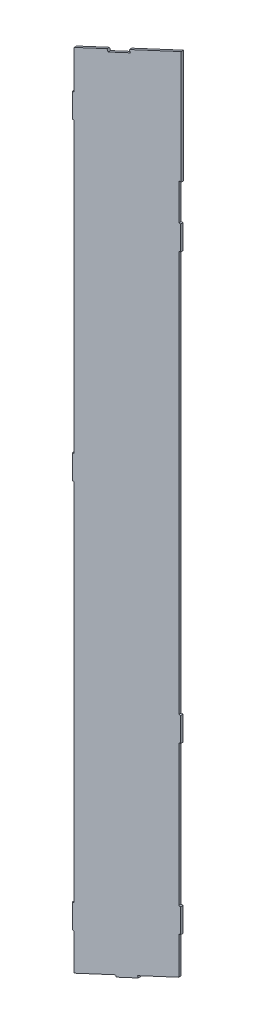
ISO-10303-21;
HEADER;
FILE_DESCRIPTION(('STEP AP214'),'2;1');
FILE_NAME('part.step','',(''),(''),'','','');
FILE_SCHEMA(('AUTOMOTIVE_DESIGN { 1 0 10303 214 1 1 1 1 }'));
ENDSEC;
DATA;
#1=APPLICATION_CONTEXT('core data for automotive mechanical design processes');
#2=APPLICATION_PROTOCOL_DEFINITION('international standard','automotive_design',2000,#1);
#3=PRODUCT_CONTEXT('',#1,'mechanical');
#4=PRODUCT('Part','Part','',(#3));
#5=PRODUCT_RELATED_PRODUCT_CATEGORY('part','',(#4));
#6=PRODUCT_DEFINITION_FORMATION('','',#4);
#7=PRODUCT_DEFINITION_CONTEXT('part definition',#1,'design');
#8=PRODUCT_DEFINITION('design','',#6,#7);
#9=PRODUCT_DEFINITION_SHAPE('','',#8);
#10=(LENGTH_UNIT() NAMED_UNIT(*) SI_UNIT(.MILLI.,.METRE.));
#11=(NAMED_UNIT(*) PLANE_ANGLE_UNIT() SI_UNIT($,.RADIAN.));
#12=(NAMED_UNIT(*) SI_UNIT($,.STERADIAN.) SOLID_ANGLE_UNIT());
#13=UNCERTAINTY_MEASURE_WITH_UNIT(LENGTH_MEASURE(1.E-05),#10,'distance_accuracy_value','');
#14=(GEOMETRIC_REPRESENTATION_CONTEXT(3) GLOBAL_UNCERTAINTY_ASSIGNED_CONTEXT((#13)) GLOBAL_UNIT_ASSIGNED_CONTEXT((#10,
#11,#12)) REPRESENTATION_CONTEXT('',''));
#15=CARTESIAN_POINT('',(0.,0.,0.));
#16=DIRECTION('',(0.,0.,1.));
#17=DIRECTION('',(1.,0.,0.));
#18=AXIS2_PLACEMENT_3D('',#15,#16,#17);
#19=CARTESIAN_POINT('',(1.2490009027033E-13,46.5,62.));
#20=DIRECTION('',(0.4226182617407,-0.90630778703665,0.));
#21=DIRECTION('',(0.90630778703665,0.4226182617407,0.));
#22=AXIS2_PLACEMENT_3D('',#19,#20,#21);
#23=PLANE('',#22);
#24=DIRECTION('',(-0.906307787036649,-0.4226182617407,0.));
#25=VECTOR('',#24,1.);
#26=CARTESIAN_POINT('',(1.2490009027033E-13,46.5,62.));
#27=LINE('',#26,#25);
#28=CARTESIAN_POINT('',(-60.9945140675664,18.0577909848508,62.));
#29=VERTEX_POINT('',#28);
#30=CARTESIAN_POINT('',(-87.9999999999998,5.46492608236004,62.));
#31=VERTEX_POINT('',#30);
#32=EDGE_CURVE('E385',#29,#31,#27,.T.);
#33=ORIENTED_EDGE('',*,*,#32,.F.);
#34=DIRECTION('',(0.,0.,-1.));
#35=VECTOR('',#34,1.);
#36=CARTESIAN_POINT('',(-60.9945140675664,18.0577909848508,62.));
#37=LINE('',#36,#35);
#38=CARTESIAN_POINT('',(-60.9945140675664,18.0577909848508,60.));
#39=VERTEX_POINT('',#38);
#40=EDGE_CURVE('E577',#29,#39,#37,.T.);
#41=ORIENTED_EDGE('',*,*,#40,.T.);
#42=DIRECTION('',(-0.906307787036649,-0.4226182617407,0.));
#43=VECTOR('',#42,1.);
#44=CARTESIAN_POINT('',(1.2490009027033E-13,46.5,60.));
#45=LINE('',#44,#43);
#46=CARTESIAN_POINT('',(-87.9999999999998,5.46492608236004,60.));
#47=VERTEX_POINT('',#46);
#48=EDGE_CURVE('E301',#39,#47,#45,.T.);
#49=ORIENTED_EDGE('',*,*,#48,.T.);
#50=DIRECTION('',(0.,0.,-1.));
#51=VECTOR('',#50,1.);
#52=CARTESIAN_POINT('',(-87.9999999999998,5.46492608236004,62.));
#53=LINE('',#52,#51);
#54=EDGE_CURVE('E317',#31,#47,#53,.T.);
#55=ORIENTED_EDGE('',*,*,#54,.F.);
#56=EDGE_LOOP('',(#33,#41,#49,#55));
#57=FACE_BOUND('',#56,.T.);
#58=ADVANCED_FACE('F36',(#57),#23,.F.);
#59=CARTESIAN_POINT('',(-1.99999999999979,-613.65889832121,62.));
#60=DIRECTION('',(-0.422618261740701,0.906307787036649,0.));
#61=DIRECTION('',(-0.906307787036649,-0.422618261740701,0.));
#62=AXIS2_PLACEMENT_3D('',#59,#60,#61);
#63=PLANE('',#62);
#64=DIRECTION('',(0.906307787036649,0.422618261740701,0.));
#65=VECTOR('',#64,1.);
#66=CARTESIAN_POINT('',(-1.99999999999979,-613.65889832121,60.));
#67=LINE('',#66,#65);
#68=CARTESIAN_POINT('',(-87.9999999999998,-653.76135692254,60.));
#69=VERTEX_POINT('',#68);
#70=CARTESIAN_POINT('',(-54.0630778703664,-637.936310239282,60.));
#71=VERTEX_POINT('',#70);
#72=EDGE_CURVE('E337',#69,#71,#67,.T.);
#73=ORIENTED_EDGE('',*,*,#72,.T.);
#74=DIRECTION('',(0.,0.,1.));
#75=VECTOR('',#74,1.);
#76=CARTESIAN_POINT('',(-54.0630778703619,-637.936310239291,60.));
#77=LINE('',#76,#75);
#78=CARTESIAN_POINT('',(-54.0630778703664,-637.936310239282,62.));
#79=VERTEX_POINT('',#78);
#80=EDGE_CURVE('E552',#71,#79,#77,.T.);
#81=ORIENTED_EDGE('',*,*,#80,.T.);
#82=DIRECTION('',(0.906307787036649,0.422618261740701,0.));
#83=VECTOR('',#82,1.);
#84=CARTESIAN_POINT('',(-1.99999999999979,-613.65889832121,62.));
#85=LINE('',#84,#83);
#86=CARTESIAN_POINT('',(-87.9999999999998,-653.76135692254,62.));
#87=VERTEX_POINT('',#86);
#88=EDGE_CURVE('E340',#87,#79,#85,.T.);
#89=ORIENTED_EDGE('',*,*,#88,.F.);
#90=DIRECTION('',(0.,0.,-1.));
#91=VECTOR('',#90,1.);
#92=CARTESIAN_POINT('',(-87.9999999999998,-653.76135692254,62.));
#93=LINE('',#92,#91);
#94=EDGE_CURVE('E44',#87,#69,#93,.T.);
#95=ORIENTED_EDGE('',*,*,#94,.T.);
#96=EDGE_LOOP('',(#73,#81,#89,#95));
#97=FACE_BOUND('',#96,.T.);
#98=ADVANCED_FACE('F335',(#97),#63,.F.);
#99=CARTESIAN_POINT('',(-1.99999999999986,-46.5,62.));
#100=DIRECTION('',(-1.,0.,0.));
#101=DIRECTION('',(0.,-1.,0.));
#102=AXIS2_PLACEMENT_3D('',#99,#100,#101);
#103=PLANE('',#102);
#104=DIRECTION('',(0.,1.,0.));
#105=VECTOR('',#104,1.);
#106=CARTESIAN_POINT('',(-1.99999999999986,-46.5,62.));
#107=LINE('',#106,#105);
#108=CARTESIAN_POINT('',(-1.99999999999979,-562.7262830049,62.));
#109=VERTEX_POINT('',#108);
#110=CARTESIAN_POINT('',(-1.99999999999981,-446.5,62.));
#111=VERTEX_POINT('',#110);
#112=EDGE_CURVE('E393',#109,#111,#107,.T.);
#113=ORIENTED_EDGE('',*,*,#112,.F.);
#114=DIRECTION('',(0.,0.,1.));
#115=VECTOR('',#114,1.);
#116=CARTESIAN_POINT('',(-1.99999999999986,-562.7262830049,60.));
#117=LINE('',#116,#115);
#118=CARTESIAN_POINT('',(-1.99999999999986,-562.7262830049,60.));
#119=VERTEX_POINT('',#118);
#120=EDGE_CURVE('E525',#119,#109,#117,.T.);
#121=ORIENTED_EDGE('',*,*,#120,.F.);
#122=DIRECTION('',(0.,1.,0.));
#123=VECTOR('',#122,1.);
#124=CARTESIAN_POINT('',(-1.99999999999986,-46.5,60.));
#125=LINE('',#124,#123);
#126=CARTESIAN_POINT('',(-1.99999999999981,-446.5,60.));
#127=VERTEX_POINT('',#126);
#128=EDGE_CURVE('E363',#119,#127,#125,.T.);
#129=ORIENTED_EDGE('',*,*,#128,.T.);
#130=DIRECTION('',(0.,0.,1.));
#131=VECTOR('',#130,1.);
#132=CARTESIAN_POINT('',(-1.99999999999977,-446.5,60.));
#133=LINE('',#132,#131);
#134=EDGE_CURVE('E505',#127,#111,#133,.T.);
#135=ORIENTED_EDGE('',*,*,#134,.T.);
#136=EDGE_LOOP('',(#113,#121,#129,#135));
#137=FACE_BOUND('',#136,.T.);
#138=ADVANCED_FACE('F607',(#137),#103,.F.);
#139=CARTESIAN_POINT('',(-1.99999999999981,-426.5,62.));
#140=VERTEX_POINT('',#139);
#141=CARTESIAN_POINT('',(-1.99999999999985,-96.5,62.));
#142=VERTEX_POINT('',#141);
#143=EDGE_CURVE('E651',#140,#142,#107,.T.);
#144=ORIENTED_EDGE('',*,*,#143,.F.);
#145=DIRECTION('',(0.,0.,1.));
#146=VECTOR('',#145,1.);
#147=CARTESIAN_POINT('',(-1.99999999999979,-426.5,60.));
#148=LINE('',#147,#146);
#149=CARTESIAN_POINT('',(-1.99999999999979,-426.5,60.));
#150=VERTEX_POINT('',#149);
#151=EDGE_CURVE('E497',#150,#140,#148,.T.);
#152=ORIENTED_EDGE('',*,*,#151,.F.);
#153=CARTESIAN_POINT('',(-1.99999999999985,-96.5,60.));
#154=VERTEX_POINT('',#153);
#155=EDGE_CURVE('E359',#150,#154,#125,.T.);
#156=ORIENTED_EDGE('',*,*,#155,.T.);
#157=DIRECTION('',(0.,0.,1.));
#158=VECTOR('',#157,1.);
#159=CARTESIAN_POINT('',(-1.99999999999978,-96.5,60.));
#160=LINE('',#159,#158);
#161=EDGE_CURVE('E477',#154,#142,#160,.T.);
#162=ORIENTED_EDGE('',*,*,#161,.T.);
#163=EDGE_LOOP('',(#144,#152,#156,#162));
#164=FACE_BOUND('',#163,.T.);
#165=ADVANCED_FACE('F644',(#164),#103,.F.);
#166=CARTESIAN_POINT('',(-1.99999999999985,-76.5,62.));
#167=VERTEX_POINT('',#166);
#168=CARTESIAN_POINT('',(-1.99999999999986,-46.5,62.));
#169=VERTEX_POINT('',#168);
#170=EDGE_CURVE('E394',#167,#169,#107,.T.);
#171=ORIENTED_EDGE('',*,*,#170,.F.);
#172=DIRECTION('',(0.,0.,1.));
#173=VECTOR('',#172,1.);
#174=CARTESIAN_POINT('',(-1.99999999999979,-76.5,60.));
#175=LINE('',#174,#173);
#176=CARTESIAN_POINT('',(-1.99999999999979,-76.5,60.));
#177=VERTEX_POINT('',#176);
#178=EDGE_CURVE('E470',#177,#167,#175,.T.);
#179=ORIENTED_EDGE('',*,*,#178,.F.);
#180=CARTESIAN_POINT('',(-1.99999999999986,-46.5,60.));
#181=VERTEX_POINT('',#180);
#182=EDGE_CURVE('E356',#177,#181,#125,.T.);
#183=ORIENTED_EDGE('',*,*,#182,.T.);
#184=DIRECTION('',(0.,0.,-1.));
#185=VECTOR('',#184,1.);
#186=CARTESIAN_POINT('',(-1.99999999999986,-46.5,62.));
#187=LINE('',#186,#185);
#188=EDGE_CURVE('E326',#169,#181,#187,.T.);
#189=ORIENTED_EDGE('',*,*,#188,.F.);
#190=EDGE_LOOP('',(#171,#179,#183,#189));
#191=FACE_BOUND('',#190,.T.);
#192=ADVANCED_FACE('F626',(#191),#103,.F.);
#193=CARTESIAN_POINT('',(-87.9999999999998,-653.76135692254,62.));
#194=DIRECTION('',(1.,0.,0.));
#195=DIRECTION('',(0.,0.,-1.));
#196=AXIS2_PLACEMENT_3D('',#193,#194,#195);
#197=PLANE('',#196);
#198=DIRECTION('',(0.,-1.,0.));
#199=VECTOR('',#198,1.);
#200=CARTESIAN_POINT('',(-87.9999999999998,-653.76135692254,62.));
#201=LINE('',#200,#199);
#202=CARTESIAN_POINT('',(-87.9999999999998,-623.76135692254,62.));
#203=VERTEX_POINT('',#202);
#204=EDGE_CURVE('E312',#203,#87,#201,.T.);
#205=ORIENTED_EDGE('',*,*,#204,.F.);
#206=DIRECTION('',(0.,0.,1.));
#207=VECTOR('',#206,1.);
#208=CARTESIAN_POINT('',(-87.9999999999997,-623.76135692254,60.));
#209=LINE('',#208,#207);
#210=CARTESIAN_POINT('',(-87.9999999999997,-623.76135692254,60.));
#211=VERTEX_POINT('',#210);
#212=EDGE_CURVE('E346',#211,#203,#209,.T.);
#213=ORIENTED_EDGE('',*,*,#212,.F.);
#214=DIRECTION('',(0.,-1.,0.));
#215=VECTOR('',#214,1.);
#216=CARTESIAN_POINT('',(-87.9999999999998,-653.76135692254,60.));
#217=LINE('',#216,#215);
#218=EDGE_CURVE('E345',#211,#69,#217,.T.);
#219=ORIENTED_EDGE('',*,*,#218,.T.);
#220=ORIENTED_EDGE('',*,*,#94,.F.);
#221=EDGE_LOOP('',(#205,#213,#219,#220));
#222=FACE_BOUND('',#221,.T.);
#223=ADVANCED_FACE('F342',(#222),#197,.F.);
#224=CARTESIAN_POINT('',(-87.9999999999998,-303.76135692254,60.));
#225=VERTEX_POINT('',#224);
#226=CARTESIAN_POINT('',(-87.9999999999998,-603.76135692254,60.));
#227=VERTEX_POINT('',#226);
#228=EDGE_CURVE('E349',#225,#227,#217,.T.);
#229=ORIENTED_EDGE('',*,*,#228,.T.);
#230=DIRECTION('',(0.,0.,1.));
#231=VECTOR('',#230,1.);
#232=CARTESIAN_POINT('',(-87.9999999999998,-603.76135692254,60.));
#233=LINE('',#232,#231);
#234=CARTESIAN_POINT('',(-87.9999999999998,-603.76135692254,62.));
#235=VERTEX_POINT('',#234);
#236=EDGE_CURVE('E452',#227,#235,#233,.T.);
#237=ORIENTED_EDGE('',*,*,#236,.T.);
#238=CARTESIAN_POINT('',(-87.9999999999998,-303.761356922539,62.));
#239=VERTEX_POINT('',#238);
#240=EDGE_CURVE('E1100',#239,#235,#201,.T.);
#241=ORIENTED_EDGE('',*,*,#240,.F.);
#242=DIRECTION('',(0.,0.,1.));
#243=VECTOR('',#242,1.);
#244=CARTESIAN_POINT('',(-87.9999999999998,-303.76135692254,60.));
#245=LINE('',#244,#243);
#246=EDGE_CURVE('E419',#225,#239,#245,.T.);
#247=ORIENTED_EDGE('',*,*,#246,.F.);
#248=EDGE_LOOP('',(#229,#237,#241,#247));
#249=FACE_BOUND('',#248,.T.);
#250=ADVANCED_FACE('F636',(#249),#197,.F.);
#251=CARTESIAN_POINT('',(-87.9999999999998,-46.3911106152693,60.));
#252=VERTEX_POINT('',#251);
#253=CARTESIAN_POINT('',(-87.9999999999998,-283.761356922539,60.));
#254=VERTEX_POINT('',#253);
#255=EDGE_CURVE('E1119',#252,#254,#217,.T.);
#256=ORIENTED_EDGE('',*,*,#255,.T.);
#257=DIRECTION('',(0.,0.,1.));
#258=VECTOR('',#257,1.);
#259=CARTESIAN_POINT('',(-87.9999999999998,-283.761356922539,60.));
#260=LINE('',#259,#258);
#261=CARTESIAN_POINT('',(-87.9999999999998,-283.761356922539,62.));
#262=VERTEX_POINT('',#261);
#263=EDGE_CURVE('E426',#254,#262,#260,.T.);
#264=ORIENTED_EDGE('',*,*,#263,.T.);
#265=CARTESIAN_POINT('',(-87.9999999999998,-46.3911106152693,62.));
#266=VERTEX_POINT('',#265);
#267=EDGE_CURVE('E399',#266,#262,#201,.T.);
#268=ORIENTED_EDGE('',*,*,#267,.F.);
#269=DIRECTION('',(0.,0.,1.));
#270=VECTOR('',#269,1.);
#271=CARTESIAN_POINT('',(-87.9999999999998,-46.3911106152693,60.));
#272=LINE('',#271,#270);
#273=EDGE_CURVE('E350',#252,#266,#272,.T.);
#274=ORIENTED_EDGE('',*,*,#273,.F.);
#275=EDGE_LOOP('',(#256,#264,#268,#274));
#276=FACE_BOUND('',#275,.T.);
#277=ADVANCED_FACE('F631',(#276),#197,.F.);
#278=CARTESIAN_POINT('',(-87.9999999999998,-26.3911106152693,60.));
#279=VERTEX_POINT('',#278);
#280=EDGE_CURVE('E304',#47,#279,#217,.T.);
#281=ORIENTED_EDGE('',*,*,#280,.T.);
#282=DIRECTION('',(0.,0.,1.));
#283=VECTOR('',#282,1.);
#284=CARTESIAN_POINT('',(-87.9999999999998,-26.3911106152693,60.));
#285=LINE('',#284,#283);
#286=CARTESIAN_POINT('',(-87.9999999999998,-26.3911106152693,62.));
#287=VERTEX_POINT('',#286);
#288=EDGE_CURVE('E400',#279,#287,#285,.T.);
#289=ORIENTED_EDGE('',*,*,#288,.T.);
#290=EDGE_CURVE('E396',#31,#287,#201,.T.);
#291=ORIENTED_EDGE('',*,*,#290,.F.);
#292=ORIENTED_EDGE('',*,*,#54,.T.);
#293=EDGE_LOOP('',(#281,#289,#291,#292));
#294=FACE_BOUND('',#293,.T.);
#295=ADVANCED_FACE('F38',(#294),#197,.F.);
#296=CARTESIAN_POINT('',(-35.9369221296333,-629.483945004468,62.));
#297=VERTEX_POINT('',#296);
#298=CARTESIAN_POINT('',(-1.99999999999979,-613.65889832121,62.));
#299=VERTEX_POINT('',#298);
#300=EDGE_CURVE('E59',#297,#299,#85,.T.);
#301=ORIENTED_EDGE('',*,*,#300,.F.);
#302=DIRECTION('',(0.,0.,1.));
#303=VECTOR('',#302,1.);
#304=CARTESIAN_POINT('',(-35.9369221296317,-629.483945004471,60.));
#305=LINE('',#304,#303);
#306=CARTESIAN_POINT('',(-35.9369221296317,-629.483945004471,60.));
#307=VERTEX_POINT('',#306);
#308=EDGE_CURVE('E565',#307,#297,#305,.T.);
#309=ORIENTED_EDGE('',*,*,#308,.F.);
#310=CARTESIAN_POINT('',(-1.99999999999979,-613.65889832121,60.));
#311=VERTEX_POINT('',#310);
#312=EDGE_CURVE('E357',#307,#311,#67,.T.);
#313=ORIENTED_EDGE('',*,*,#312,.T.);
#314=DIRECTION('',(0.,0.,-1.));
#315=VECTOR('',#314,1.);
#316=CARTESIAN_POINT('',(-1.99999999999979,-613.65889832121,62.));
#317=LINE('',#316,#315);
#318=EDGE_CURVE('E329',#299,#311,#317,.T.);
#319=ORIENTED_EDGE('',*,*,#318,.F.);
#320=EDGE_LOOP('',(#301,#309,#313,#319));
#321=FACE_BOUND('',#320,.T.);
#322=ADVANCED_FACE('F608',(#321),#63,.F.);
#323=CARTESIAN_POINT('',(-1.99999999999979,-582.7262830049,60.));
#324=VERTEX_POINT('',#323);
#325=EDGE_CURVE('E361',#311,#324,#125,.T.);
#326=ORIENTED_EDGE('',*,*,#325,.T.);
#327=DIRECTION('',(0.,0.,1.));
#328=VECTOR('',#327,1.);
#329=CARTESIAN_POINT('',(-1.99999999999986,-582.7262830049,60.));
#330=LINE('',#329,#328);
#331=CARTESIAN_POINT('',(-1.99999999999979,-582.7262830049,62.));
#332=VERTEX_POINT('',#331);
#333=EDGE_CURVE('E533',#324,#332,#330,.T.);
#334=ORIENTED_EDGE('',*,*,#333,.T.);
#335=EDGE_CURVE('E390',#299,#332,#107,.T.);
#336=ORIENTED_EDGE('',*,*,#335,.F.);
#337=ORIENTED_EDGE('',*,*,#318,.T.);
#338=EDGE_LOOP('',(#326,#334,#336,#337));
#339=FACE_BOUND('',#338,.T.);
#340=ADVANCED_FACE('F621',(#339),#103,.F.);
#341=CARTESIAN_POINT('',(1.45716771982052E-13,-46.5,62.));
#342=DIRECTION('',(0.,1.,0.));
#343=DIRECTION('',(0.,0.,1.));
#344=AXIS2_PLACEMENT_3D('',#341,#342,#343);
#345=PLANE('',#344);
#346=DIRECTION('',(1.,0.,0.));
#347=VECTOR('',#346,1.);
#348=CARTESIAN_POINT('',(1.45716771982052E-13,-46.5,60.));
#349=LINE('',#348,#347);
#350=CARTESIAN_POINT('',(1.45716771982052E-13,-46.5,60.));
#351=VERTEX_POINT('',#350);
#352=EDGE_CURVE('E313',#181,#351,#349,.T.);
#353=ORIENTED_EDGE('',*,*,#352,.T.);
#354=DIRECTION('',(0.,0.,-1.));
#355=VECTOR('',#354,1.);
#356=CARTESIAN_POINT('',(1.45716771982052E-13,-46.5,62.));
#357=LINE('',#356,#355);
#358=CARTESIAN_POINT('',(1.45716771982052E-13,-46.5,62.));
#359=VERTEX_POINT('',#358);
#360=EDGE_CURVE('E323',#359,#351,#357,.T.);
#361=ORIENTED_EDGE('',*,*,#360,.F.);
#362=DIRECTION('',(1.,0.,0.));
#363=VECTOR('',#362,1.);
#364=CARTESIAN_POINT('',(1.45716771982052E-13,-46.5,62.));
#365=LINE('',#364,#363);
#366=EDGE_CURVE('E388',#169,#359,#365,.T.);
#367=ORIENTED_EDGE('',*,*,#366,.F.);
#368=ORIENTED_EDGE('',*,*,#188,.T.);
#369=EDGE_LOOP('',(#353,#361,#367,#368));
#370=FACE_BOUND('',#369,.T.);
#371=ADVANCED_FACE('F367',(#370),#345,.F.);
#372=CARTESIAN_POINT('',(1.2490009027033E-13,46.5,62.));
#373=DIRECTION('',(-1.,0.,0.));
#374=DIRECTION('',(0.,-1.,0.));
#375=AXIS2_PLACEMENT_3D('',#372,#373,#374);
#376=PLANE('',#375);
#377=DIRECTION('',(0.,1.,0.));
#378=VECTOR('',#377,1.);
#379=CARTESIAN_POINT('',(1.2490009027033E-13,46.5,60.));
#380=LINE('',#379,#378);
#381=CARTESIAN_POINT('',(1.2490009027033E-13,46.5,60.));
#382=VERTEX_POINT('',#381);
#383=EDGE_CURVE('E309',#351,#382,#380,.T.);
#384=ORIENTED_EDGE('',*,*,#383,.T.);
#385=DIRECTION('',(0.,0.,-1.));
#386=VECTOR('',#385,1.);
#387=CARTESIAN_POINT('',(1.2490009027033E-13,46.5,62.));
#388=LINE('',#387,#386);
#389=CARTESIAN_POINT('',(1.2490009027033E-13,46.5,62.));
#390=VERTEX_POINT('',#389);
#391=EDGE_CURVE('E319',#390,#382,#388,.T.);
#392=ORIENTED_EDGE('',*,*,#391,.F.);
#393=DIRECTION('',(0.,1.,0.));
#394=VECTOR('',#393,1.);
#395=CARTESIAN_POINT('',(1.2490009027033E-13,46.5,62.));
#396=LINE('',#395,#394);
#397=EDGE_CURVE('E375',#359,#390,#396,.T.);
#398=ORIENTED_EDGE('',*,*,#397,.F.);
#399=ORIENTED_EDGE('',*,*,#360,.T.);
#400=EDGE_LOOP('',(#384,#392,#398,#399));
#401=FACE_BOUND('',#400,.T.);
#402=ADVANCED_FACE('F373',(#401),#376,.F.);
#403=CARTESIAN_POINT('',(-42.6870967694261,26.594679872013,60.));
#404=VERTEX_POINT('',#403);
#405=EDGE_CURVE('E308',#382,#404,#45,.T.);
#406=ORIENTED_EDGE('',*,*,#405,.T.);
#407=DIRECTION('',(0.,0.,1.));
#408=VECTOR('',#407,1.);
#409=CARTESIAN_POINT('',(-42.6870967694261,26.594679872013,62.));
#410=LINE('',#409,#408);
#411=CARTESIAN_POINT('',(-42.6870967694261,26.594679872013,62.));
#412=VERTEX_POINT('',#411);
#413=EDGE_CURVE('E381',#404,#412,#410,.T.);
#414=ORIENTED_EDGE('',*,*,#413,.T.);
#415=EDGE_CURVE('E320',#390,#412,#27,.T.);
#416=ORIENTED_EDGE('',*,*,#415,.F.);
#417=ORIENTED_EDGE('',*,*,#391,.T.);
#418=EDGE_LOOP('',(#406,#414,#416,#417));
#419=FACE_BOUND('',#418,.T.);
#420=ADVANCED_FACE('F379',(#419),#23,.F.);
#421=CARTESIAN_POINT('',(0.,0.,62.));
#422=DIRECTION('',(0.,0.,1.));
#423=DIRECTION('',(1.,0.,0.));
#424=AXIS2_PLACEMENT_3D('',#421,#422,#423);
#425=PLANE('',#424);
#426=DIRECTION('',(0.422618261740698,-0.90630778703665,0.));
#427=VECTOR('',#426,1.);
#428=CARTESIAN_POINT('',(-61.0367758937405,18.1484217635545,62.));
#429=LINE('',#428,#427);
#430=CARTESIAN_POINT('',(-60.107015717911,16.1545446320739,62.));
#431=VERTEX_POINT('',#430);
#432=EDGE_CURVE('E286',#29,#431,#429,.T.);
#433=ORIENTED_EDGE('',*,*,#432,.F.);
#434=ORIENTED_EDGE('',*,*,#32,.T.);
#435=ORIENTED_EDGE('',*,*,#290,.T.);
#436=DIRECTION('',(-1.,0.,0.));
#437=VECTOR('',#436,1.);
#438=CARTESIAN_POINT('',(-87.9999999999998,-26.3911106152693,62.));
#439=LINE('',#438,#437);
#440=CARTESIAN_POINT('',(-89.4999999999997,-26.3911106152693,62.));
#441=VERTEX_POINT('',#440);
#442=EDGE_CURVE('E416',#287,#441,#439,.T.);
#443=ORIENTED_EDGE('',*,*,#442,.T.);
#444=DIRECTION('',(0.,-1.,0.));
#445=VECTOR('',#444,1.);
#446=CARTESIAN_POINT('',(-89.4999999999997,-26.3911106152693,62.));
#447=LINE('',#446,#445);
#448=CARTESIAN_POINT('',(-89.4999999999997,-46.3911106152693,62.));
#449=VERTEX_POINT('',#448);
#450=EDGE_CURVE('E413',#441,#449,#447,.T.);
#451=ORIENTED_EDGE('',*,*,#450,.T.);
#452=DIRECTION('',(1.,0.,0.));
#453=VECTOR('',#452,1.);
#454=CARTESIAN_POINT('',(-87.9999999999998,-46.3911106152693,62.));
#455=LINE('',#454,#453);
#456=EDGE_CURVE('E409',#449,#266,#455,.T.);
#457=ORIENTED_EDGE('',*,*,#456,.T.);
#458=ORIENTED_EDGE('',*,*,#267,.T.);
#459=DIRECTION('',(-1.,0.,0.));
#460=VECTOR('',#459,1.);
#461=CARTESIAN_POINT('',(-87.9999999999998,-283.761356922539,62.));
#462=LINE('',#461,#460);
#463=CARTESIAN_POINT('',(-89.4999999999997,-283.761356922539,62.));
#464=VERTEX_POINT('',#463);
#465=EDGE_CURVE('E442',#262,#464,#462,.T.);
#466=ORIENTED_EDGE('',*,*,#465,.T.);
#467=DIRECTION('',(0.,-1.,0.));
#468=VECTOR('',#467,1.);
#469=CARTESIAN_POINT('',(-89.4999999999997,-283.761356922539,62.));
#470=LINE('',#469,#468);
#471=CARTESIAN_POINT('',(-89.4999999999997,-303.761356922539,62.));
#472=VERTEX_POINT('',#471);
#473=EDGE_CURVE('E439',#464,#472,#470,.T.);
#474=ORIENTED_EDGE('',*,*,#473,.T.);
#475=DIRECTION('',(1.,0.,0.));
#476=VECTOR('',#475,1.);
#477=CARTESIAN_POINT('',(-87.9999999999998,-303.76135692254,62.));
#478=LINE('',#477,#476);
#479=EDGE_CURVE('E435',#472,#239,#478,.T.);
#480=ORIENTED_EDGE('',*,*,#479,.T.);
#481=ORIENTED_EDGE('',*,*,#240,.T.);
#482=DIRECTION('',(-1.,0.,0.));
#483=VECTOR('',#482,1.);
#484=CARTESIAN_POINT('',(-87.9999999999998,-603.76135692254,62.));
#485=LINE('',#484,#483);
#486=CARTESIAN_POINT('',(-89.4999999999996,-603.76135692254,62.));
#487=VERTEX_POINT('',#486);
#488=EDGE_CURVE('E467',#235,#487,#485,.T.);
#489=ORIENTED_EDGE('',*,*,#488,.T.);
#490=DIRECTION('',(0.,-1.,0.));
#491=VECTOR('',#490,1.);
#492=CARTESIAN_POINT('',(-89.4999999999996,-603.76135692254,62.));
#493=LINE('',#492,#491);
#494=CARTESIAN_POINT('',(-89.4999999999996,-623.76135692254,62.));
#495=VERTEX_POINT('',#494);
#496=EDGE_CURVE('E464',#487,#495,#493,.T.);
#497=ORIENTED_EDGE('',*,*,#496,.T.);
#498=DIRECTION('',(1.,0.,0.));
#499=VECTOR('',#498,1.);
#500=CARTESIAN_POINT('',(-87.9999999999997,-623.76135692254,62.));
#501=LINE('',#500,#499);
#502=EDGE_CURVE('E460',#495,#203,#501,.T.);
#503=ORIENTED_EDGE('',*,*,#502,.T.);
#504=ORIENTED_EDGE('',*,*,#204,.T.);
#505=ORIENTED_EDGE('',*,*,#88,.T.);
#506=DIRECTION('',(0.4226182617407,-0.90630778703665,0.));
#507=VECTOR('',#506,1.);
#508=CARTESIAN_POINT('',(-54.0630778703619,-637.936310239291,62.));
#509=LINE('',#508,#507);
#510=CARTESIAN_POINT('',(-53.4291504777547,-639.295771919838,62.));
#511=VERTEX_POINT('',#510);
#512=EDGE_CURVE('E574',#79,#511,#509,.T.);
#513=ORIENTED_EDGE('',*,*,#512,.T.);
#514=DIRECTION('',(0.906307787036699,0.422618261740593,0.));
#515=VECTOR('',#514,1.);
#516=CARTESIAN_POINT('',(-53.4291504777547,-639.295771919838,62.));
#517=LINE('',#516,#515);
#518=CARTESIAN_POINT('',(-35.3029947370208,-630.843406685026,62.));
#519=VERTEX_POINT('',#518);
#520=EDGE_CURVE('E571',#511,#519,#517,.T.);
#521=ORIENTED_EDGE('',*,*,#520,.T.);
#522=DIRECTION('',(-0.422618261740641,0.906307787036677,0.));
#523=VECTOR('',#522,1.);
#524=CARTESIAN_POINT('',(-35.9369221296317,-629.483945004471,62.));
#525=LINE('',#524,#523);
#526=EDGE_CURVE('E568',#519,#297,#525,.T.);
#527=ORIENTED_EDGE('',*,*,#526,.T.);
#528=ORIENTED_EDGE('',*,*,#300,.T.);
#529=ORIENTED_EDGE('',*,*,#335,.T.);
#530=DIRECTION('',(1.,0.,0.));
#531=VECTOR('',#530,1.);
#532=CARTESIAN_POINT('',(-1.99999999999986,-582.7262830049,62.));
#533=LINE('',#532,#531);
#534=CARTESIAN_POINT('',(-0.499999999999855,-582.7262830049,62.));
#535=VERTEX_POINT('',#534);
#536=EDGE_CURVE('E549',#332,#535,#533,.T.);
#537=ORIENTED_EDGE('',*,*,#536,.T.);
#538=DIRECTION('',(0.,1.,0.));
#539=VECTOR('',#538,1.);
#540=CARTESIAN_POINT('',(-0.499999999999855,-562.7262830049,62.));
#541=LINE('',#540,#539);
#542=CARTESIAN_POINT('',(-0.499999999999855,-562.7262830049,62.));
#543=VERTEX_POINT('',#542);
#544=EDGE_CURVE('E546',#535,#543,#541,.T.);
#545=ORIENTED_EDGE('',*,*,#544,.T.);
#546=DIRECTION('',(-1.,0.,0.));
#547=VECTOR('',#546,1.);
#548=CARTESIAN_POINT('',(-1.99999999999986,-562.7262830049,62.));
#549=LINE('',#548,#547);
#550=EDGE_CURVE('E542',#543,#109,#549,.T.);
#551=ORIENTED_EDGE('',*,*,#550,.T.);
#552=ORIENTED_EDGE('',*,*,#112,.T.);
#553=DIRECTION('',(1.,0.,0.));
#554=VECTOR('',#553,1.);
#555=CARTESIAN_POINT('',(-1.99999999999977,-446.5,62.));
#556=LINE('',#555,#554);
#557=CARTESIAN_POINT('',(-0.499999999999869,-446.5,62.));
#558=VERTEX_POINT('',#557);
#559=EDGE_CURVE('E522',#111,#558,#556,.T.);
#560=ORIENTED_EDGE('',*,*,#559,.T.);
#561=DIRECTION('',(0.,1.,0.));
#562=VECTOR('',#561,1.);
#563=CARTESIAN_POINT('',(-0.499999999999876,-426.5,62.));
#564=LINE('',#563,#562);
#565=CARTESIAN_POINT('',(-0.499999999999876,-426.5,62.));
#566=VERTEX_POINT('',#565);
#567=EDGE_CURVE('E519',#558,#566,#564,.T.);
#568=ORIENTED_EDGE('',*,*,#567,.T.);
#569=DIRECTION('',(-1.,0.,0.));
#570=VECTOR('',#569,1.);
#571=CARTESIAN_POINT('',(-1.99999999999979,-426.5,62.));
#572=LINE('',#571,#570);
#573=EDGE_CURVE('E515',#566,#140,#572,.T.);
#574=ORIENTED_EDGE('',*,*,#573,.T.);
#575=ORIENTED_EDGE('',*,*,#143,.T.);
#576=DIRECTION('',(1.,0.,0.));
#577=VECTOR('',#576,1.);
#578=CARTESIAN_POINT('',(-1.99999999999978,-96.5,62.));
#579=LINE('',#578,#577);
#580=CARTESIAN_POINT('',(-0.499999999999917,-96.5,62.));
#581=VERTEX_POINT('',#580);
#582=EDGE_CURVE('E494',#142,#581,#579,.T.);
#583=ORIENTED_EDGE('',*,*,#582,.T.);
#584=DIRECTION('',(0.,1.,0.));
#585=VECTOR('',#584,1.);
#586=CARTESIAN_POINT('',(-0.499999999999917,-76.5,62.));
#587=LINE('',#586,#585);
#588=CARTESIAN_POINT('',(-0.499999999999917,-76.5,62.));
#589=VERTEX_POINT('',#588);
#590=EDGE_CURVE('E491',#581,#589,#587,.T.);
#591=ORIENTED_EDGE('',*,*,#590,.T.);
#592=DIRECTION('',(-1.,0.,0.));
#593=VECTOR('',#592,1.);
#594=CARTESIAN_POINT('',(-1.99999999999979,-76.5,62.));
#595=LINE('',#594,#593);
#596=EDGE_CURVE('E487',#589,#167,#595,.T.);
#597=ORIENTED_EDGE('',*,*,#596,.T.);
#598=ORIENTED_EDGE('',*,*,#170,.T.);
#599=ORIENTED_EDGE('',*,*,#366,.T.);
#600=ORIENTED_EDGE('',*,*,#397,.T.);
#601=ORIENTED_EDGE('',*,*,#415,.T.);
#602=DIRECTION('',(-0.422618261740702,0.906307787036649,0.));
#603=VECTOR('',#602,1.);
#604=CARTESIAN_POINT('',(-42.7293585956002,26.6853106507167,62.));
#605=LINE('',#604,#603);
#606=CARTESIAN_POINT('',(-41.7995984197706,24.6914335192361,62.));
#607=VERTEX_POINT('',#606);
#608=EDGE_CURVE('E296',#607,#412,#605,.T.);
#609=ORIENTED_EDGE('',*,*,#608,.F.);
#610=DIRECTION('',(0.90630778703665,0.4226182617407,0.));
#611=VECTOR('',#610,1.);
#612=CARTESIAN_POINT('',(-60.107015717911,16.1545446320739,62.));
#613=LINE('',#612,#611);
#614=EDGE_CURVE('E588',#431,#607,#613,.T.);
#615=ORIENTED_EDGE('',*,*,#614,.F.);
#616=EDGE_LOOP('',(#433,#434,#435,#443,#451,#457,#458,#466,#474,#480,#481,#489,#497,#503,#504,
#505,#513,#521,#527,#528,#529,#537,#545,#551,#552,#560,#568,#574,#575,#583,#591,#597,#598,#599,
#600,#601,#609,#615));
#617=FACE_BOUND('',#616,.T.);
#618=ADVANCED_FACE('F591',(#617),#425,.T.);
#619=CARTESIAN_POINT('',(0.,0.,60.));
#620=DIRECTION('',(0.,0.,1.));
#621=DIRECTION('',(1.,0.,0.));
#622=AXIS2_PLACEMENT_3D('',#619,#620,#621);
#623=PLANE('',#622);
#624=ORIENTED_EDGE('',*,*,#48,.F.);
#625=DIRECTION('',(0.422618261740698,-0.906307787036651,0.));
#626=VECTOR('',#625,1.);
#627=CARTESIAN_POINT('',(-43.1839807650503,-20.1370209403611,60.));
#628=LINE('',#627,#626);
#629=CARTESIAN_POINT('',(-60.107015717911,16.1545446320739,60.));
#630=VERTEX_POINT('',#629);
#631=EDGE_CURVE('E11',#39,#630,#628,.T.);
#632=ORIENTED_EDGE('',*,*,#631,.T.);
#633=DIRECTION('',(0.90630778703665,0.4226182617407,0.));
#634=VECTOR('',#633,1.);
#635=CARTESIAN_POINT('',(-60.107015717911,16.1545446320739,60.));
#636=LINE('',#635,#634);
#637=CARTESIAN_POINT('',(-41.7995984197706,24.6914335192361,60.));
#638=VERTEX_POINT('',#637);
#639=EDGE_CURVE('E293',#630,#638,#636,.T.);
#640=ORIENTED_EDGE('',*,*,#639,.T.);
#641=DIRECTION('',(-0.422618261740702,0.906307787036649,0.));
#642=VECTOR('',#641,1.);
#643=CARTESIAN_POINT('',(-42.7293585956002,26.6853106507167,60.));
#644=LINE('',#643,#642);
#645=EDGE_CURVE('E51',#638,#404,#644,.T.);
#646=ORIENTED_EDGE('',*,*,#645,.T.);
#647=ORIENTED_EDGE('',*,*,#405,.F.);
#648=ORIENTED_EDGE('',*,*,#383,.F.);
#649=ORIENTED_EDGE('',*,*,#352,.F.);
#650=ORIENTED_EDGE('',*,*,#182,.F.);
#651=DIRECTION('',(-1.,0.,0.));
#652=VECTOR('',#651,1.);
#653=CARTESIAN_POINT('',(-1.99999999999979,-76.5,60.));
#654=LINE('',#653,#652);
#655=CARTESIAN_POINT('',(-0.499999999999917,-76.5,60.));
#656=VERTEX_POINT('',#655);
#657=EDGE_CURVE('E481',#656,#177,#654,.T.);
#658=ORIENTED_EDGE('',*,*,#657,.F.);
#659=DIRECTION('',(0.,1.,0.));
#660=VECTOR('',#659,1.);
#661=CARTESIAN_POINT('',(-0.499999999999917,-76.5,60.));
#662=LINE('',#661,#660);
#663=CARTESIAN_POINT('',(-0.499999999999917,-96.5,60.));
#664=VERTEX_POINT('',#663);
#665=EDGE_CURVE('E500',#664,#656,#662,.T.);
#666=ORIENTED_EDGE('',*,*,#665,.F.);
#667=DIRECTION('',(1.,0.,0.));
#668=VECTOR('',#667,1.);
#669=CARTESIAN_POINT('',(-1.99999999999978,-96.5,60.));
#670=LINE('',#669,#668);
#671=EDGE_CURVE('E490',#154,#664,#670,.T.);
#672=ORIENTED_EDGE('',*,*,#671,.F.);
#673=ORIENTED_EDGE('',*,*,#155,.F.);
#674=DIRECTION('',(-1.,0.,0.));
#675=VECTOR('',#674,1.);
#676=CARTESIAN_POINT('',(-1.99999999999979,-426.5,60.));
#677=LINE('',#676,#675);
#678=CARTESIAN_POINT('',(-0.499999999999876,-426.5,60.));
#679=VERTEX_POINT('',#678);
#680=EDGE_CURVE('E509',#679,#150,#677,.T.);
#681=ORIENTED_EDGE('',*,*,#680,.F.);
#682=DIRECTION('',(0.,1.,0.));
#683=VECTOR('',#682,1.);
#684=CARTESIAN_POINT('',(-0.499999999999876,-426.5,60.));
#685=LINE('',#684,#683);
#686=CARTESIAN_POINT('',(-0.499999999999869,-446.5,60.));
#687=VERTEX_POINT('',#686);
#688=EDGE_CURVE('E528',#687,#679,#685,.T.);
#689=ORIENTED_EDGE('',*,*,#688,.F.);
#690=DIRECTION('',(1.,0.,0.));
#691=VECTOR('',#690,1.);
#692=CARTESIAN_POINT('',(-1.99999999999977,-446.5,60.));
#693=LINE('',#692,#691);
#694=EDGE_CURVE('E518',#127,#687,#693,.T.);
#695=ORIENTED_EDGE('',*,*,#694,.F.);
#696=ORIENTED_EDGE('',*,*,#128,.F.);
#697=DIRECTION('',(-1.,0.,0.));
#698=VECTOR('',#697,1.);
#699=CARTESIAN_POINT('',(-1.99999999999986,-562.7262830049,60.));
#700=LINE('',#699,#698);
#701=CARTESIAN_POINT('',(-0.499999999999855,-562.7262830049,60.));
#702=VERTEX_POINT('',#701);
#703=EDGE_CURVE('E536',#702,#119,#700,.T.);
#704=ORIENTED_EDGE('',*,*,#703,.F.);
#705=DIRECTION('',(0.,1.,0.));
#706=VECTOR('',#705,1.);
#707=CARTESIAN_POINT('',(-0.499999999999855,-562.7262830049,60.));
#708=LINE('',#707,#706);
#709=CARTESIAN_POINT('',(-0.499999999999855,-582.7262830049,60.));
#710=VERTEX_POINT('',#709);
#711=EDGE_CURVE('E555',#710,#702,#708,.T.);
#712=ORIENTED_EDGE('',*,*,#711,.F.);
#713=DIRECTION('',(1.,0.,0.));
#714=VECTOR('',#713,1.);
#715=CARTESIAN_POINT('',(-1.99999999999986,-582.7262830049,60.));
#716=LINE('',#715,#714);
#717=EDGE_CURVE('E545',#324,#710,#716,.T.);
#718=ORIENTED_EDGE('',*,*,#717,.F.);
#719=ORIENTED_EDGE('',*,*,#325,.F.);
#720=ORIENTED_EDGE('',*,*,#312,.F.);
#721=DIRECTION('',(-0.422618261740641,0.906307787036677,0.));
#722=VECTOR('',#721,1.);
#723=CARTESIAN_POINT('',(-35.9369221296317,-629.483945004471,60.));
#724=LINE('',#723,#722);
#725=CARTESIAN_POINT('',(-35.3029947370208,-630.843406685026,60.));
#726=VERTEX_POINT('',#725);
#727=EDGE_CURVE('E563',#726,#307,#724,.T.);
#728=ORIENTED_EDGE('',*,*,#727,.F.);
#729=DIRECTION('',(0.906307787036699,0.422618261740593,0.));
#730=VECTOR('',#729,1.);
#731=CARTESIAN_POINT('',(-53.4291504777547,-639.295771919838,60.));
#732=LINE('',#731,#730);
#733=CARTESIAN_POINT('',(-53.4291504777547,-639.295771919838,60.));
#734=VERTEX_POINT('',#733);
#735=EDGE_CURVE('E580',#734,#726,#732,.T.);
#736=ORIENTED_EDGE('',*,*,#735,.F.);
#737=DIRECTION('',(0.4226182617407,-0.90630778703665,0.));
#738=VECTOR('',#737,1.);
#739=CARTESIAN_POINT('',(-54.0630778703619,-637.936310239291,60.));
#740=LINE('',#739,#738);
#741=EDGE_CURVE('E355',#71,#734,#740,.T.);
#742=ORIENTED_EDGE('',*,*,#741,.F.);
#743=ORIENTED_EDGE('',*,*,#72,.F.);
#744=ORIENTED_EDGE('',*,*,#218,.F.);
#745=DIRECTION('',(1.,0.,0.));
#746=VECTOR('',#745,1.);
#747=CARTESIAN_POINT('',(-87.9999999999997,-623.76135692254,60.));
#748=LINE('',#747,#746);
#749=CARTESIAN_POINT('',(-89.4999999999996,-623.76135692254,60.));
#750=VERTEX_POINT('',#749);
#751=EDGE_CURVE('E455',#750,#211,#748,.T.);
#752=ORIENTED_EDGE('',*,*,#751,.F.);
#753=DIRECTION('',(0.,-1.,0.));
#754=VECTOR('',#753,1.);
#755=CARTESIAN_POINT('',(-89.4999999999996,-603.76135692254,60.));
#756=LINE('',#755,#754);
#757=CARTESIAN_POINT('',(-89.4999999999996,-603.76135692254,60.));
#758=VERTEX_POINT('',#757);
#759=EDGE_CURVE('E472',#758,#750,#756,.T.);
#760=ORIENTED_EDGE('',*,*,#759,.F.);
#761=DIRECTION('',(-1.,0.,0.));
#762=VECTOR('',#761,1.);
#763=CARTESIAN_POINT('',(-87.9999999999998,-603.76135692254,60.));
#764=LINE('',#763,#762);
#765=EDGE_CURVE('E463',#227,#758,#764,.T.);
#766=ORIENTED_EDGE('',*,*,#765,.F.);
#767=ORIENTED_EDGE('',*,*,#228,.F.);
#768=DIRECTION('',(1.,0.,0.));
#769=VECTOR('',#768,1.);
#770=CARTESIAN_POINT('',(-87.9999999999998,-303.76135692254,60.));
#771=LINE('',#770,#769);
#772=CARTESIAN_POINT('',(-89.4999999999997,-303.761356922539,60.));
#773=VERTEX_POINT('',#772);
#774=EDGE_CURVE('E429',#773,#225,#771,.T.);
#775=ORIENTED_EDGE('',*,*,#774,.F.);
#776=DIRECTION('',(0.,-1.,0.));
#777=VECTOR('',#776,1.);
#778=CARTESIAN_POINT('',(-89.4999999999997,-283.761356922539,60.));
#779=LINE('',#778,#777);
#780=CARTESIAN_POINT('',(-89.4999999999997,-283.761356922539,60.));
#781=VERTEX_POINT('',#780);
#782=EDGE_CURVE('E447',#781,#773,#779,.T.);
#783=ORIENTED_EDGE('',*,*,#782,.F.);
#784=DIRECTION('',(-1.,0.,0.));
#785=VECTOR('',#784,1.);
#786=CARTESIAN_POINT('',(-87.9999999999998,-283.761356922539,60.));
#787=LINE('',#786,#785);
#788=EDGE_CURVE('E438',#254,#781,#787,.T.);
#789=ORIENTED_EDGE('',*,*,#788,.F.);
#790=ORIENTED_EDGE('',*,*,#255,.F.);
#791=DIRECTION('',(1.,0.,0.));
#792=VECTOR('',#791,1.);
#793=CARTESIAN_POINT('',(-87.9999999999998,-46.3911106152693,60.));
#794=LINE('',#793,#792);
#795=CARTESIAN_POINT('',(-89.4999999999997,-46.3911106152693,60.));
#796=VERTEX_POINT('',#795);
#797=EDGE_CURVE('E404',#796,#252,#794,.T.);
#798=ORIENTED_EDGE('',*,*,#797,.F.);
#799=DIRECTION('',(0.,-1.,0.));
#800=VECTOR('',#799,1.);
#801=CARTESIAN_POINT('',(-89.4999999999997,-26.3911106152693,60.));
#802=LINE('',#801,#800);
#803=CARTESIAN_POINT('',(-89.4999999999997,-26.3911106152693,60.));
#804=VERTEX_POINT('',#803);
#805=EDGE_CURVE('E421',#804,#796,#802,.T.);
#806=ORIENTED_EDGE('',*,*,#805,.F.);
#807=DIRECTION('',(-1.,0.,0.));
#808=VECTOR('',#807,1.);
#809=CARTESIAN_POINT('',(-87.9999999999998,-26.3911106152693,60.));
#810=LINE('',#809,#808);
#811=EDGE_CURVE('E412',#279,#804,#810,.T.);
#812=ORIENTED_EDGE('',*,*,#811,.F.);
#813=ORIENTED_EDGE('',*,*,#280,.F.);
#814=EDGE_LOOP('',(#624,#632,#640,#646,#647,#648,#649,#650,#658,#666,#672,#673,#681,#689,#695,
#696,#704,#712,#718,#719,#720,#728,#736,#742,#743,#744,#752,#760,#766,#767,#775,#783,#789,#790,
#798,#806,#812,#813));
#815=FACE_BOUND('',#814,.T.);
#816=ADVANCED_FACE('F299',(#815),#623,.F.);
#817=CARTESIAN_POINT('',(-87.9999999999998,-46.3911106152693,60.));
#818=DIRECTION('',(0.,-1.,0.));
#819=DIRECTION('',(0.,0.,-1.));
#820=AXIS2_PLACEMENT_3D('',#817,#818,#819);
#821=PLANE('',#820);
#822=ORIENTED_EDGE('',*,*,#456,.F.);
#823=DIRECTION('',(0.,0.,1.));
#824=VECTOR('',#823,1.);
#825=CARTESIAN_POINT('',(-89.4999999999997,-46.3911106152693,60.));
#826=LINE('',#825,#824);
#827=EDGE_CURVE('E406',#796,#449,#826,.T.);
#828=ORIENTED_EDGE('',*,*,#827,.F.);
#829=ORIENTED_EDGE('',*,*,#797,.T.);
#830=ORIENTED_EDGE('',*,*,#273,.T.);
#831=EDGE_LOOP('',(#822,#828,#829,#830));
#832=FACE_BOUND('',#831,.T.);
#833=ADVANCED_FACE('F727',(#832),#821,.T.);
#834=CARTESIAN_POINT('',(-89.4999999999997,-26.3911106152693,60.));
#835=DIRECTION('',(-1.,0.,0.));
#836=DIRECTION('',(0.,0.,1.));
#837=AXIS2_PLACEMENT_3D('',#834,#835,#836);
#838=PLANE('',#837);
#839=ORIENTED_EDGE('',*,*,#450,.F.);
#840=DIRECTION('',(0.,0.,1.));
#841=VECTOR('',#840,1.);
#842=CARTESIAN_POINT('',(-89.4999999999997,-26.3911106152693,60.));
#843=LINE('',#842,#841);
#844=EDGE_CURVE('E403',#804,#441,#843,.T.);
#845=ORIENTED_EDGE('',*,*,#844,.F.);
#846=ORIENTED_EDGE('',*,*,#805,.T.);
#847=ORIENTED_EDGE('',*,*,#827,.T.);
#848=EDGE_LOOP('',(#839,#845,#846,#847));
#849=FACE_BOUND('',#848,.T.);
#850=ADVANCED_FACE('F730',(#849),#838,.T.);
#851=CARTESIAN_POINT('',(-87.9999999999998,-26.3911106152693,60.));
#852=DIRECTION('',(0.,1.,0.));
#853=DIRECTION('',(0.,0.,1.));
#854=AXIS2_PLACEMENT_3D('',#851,#852,#853);
#855=PLANE('',#854);
#856=ORIENTED_EDGE('',*,*,#442,.F.);
#857=ORIENTED_EDGE('',*,*,#288,.F.);
#858=ORIENTED_EDGE('',*,*,#811,.T.);
#859=ORIENTED_EDGE('',*,*,#844,.T.);
#860=EDGE_LOOP('',(#856,#857,#858,#859));
#861=FACE_BOUND('',#860,.T.);
#862=ADVANCED_FACE('F719',(#861),#855,.T.);
#863=CARTESIAN_POINT('',(-87.9999999999998,-303.76135692254,60.));
#864=DIRECTION('',(0.,-1.,0.));
#865=DIRECTION('',(1.,0.,0.));
#866=AXIS2_PLACEMENT_3D('',#863,#864,#865);
#867=PLANE('',#866);
#868=ORIENTED_EDGE('',*,*,#479,.F.);
#869=DIRECTION('',(0.,0.,1.));
#870=VECTOR('',#869,1.);
#871=CARTESIAN_POINT('',(-89.4999999999997,-303.761356922539,60.));
#872=LINE('',#871,#870);
#873=EDGE_CURVE('E431',#773,#472,#872,.T.);
#874=ORIENTED_EDGE('',*,*,#873,.F.);
#875=ORIENTED_EDGE('',*,*,#774,.T.);
#876=ORIENTED_EDGE('',*,*,#246,.T.);
#877=EDGE_LOOP('',(#868,#874,#875,#876));
#878=FACE_BOUND('',#877,.T.);
#879=ADVANCED_FACE('F715',(#878),#867,.T.);
#880=CARTESIAN_POINT('',(-89.4999999999997,-283.761356922539,60.));
#881=DIRECTION('',(-1.,0.,0.));
#882=DIRECTION('',(0.,0.,1.));
#883=AXIS2_PLACEMENT_3D('',#880,#881,#882);
#884=PLANE('',#883);
#885=ORIENTED_EDGE('',*,*,#473,.F.);
#886=DIRECTION('',(0.,0.,1.));
#887=VECTOR('',#886,1.);
#888=CARTESIAN_POINT('',(-89.4999999999997,-283.761356922539,60.));
#889=LINE('',#888,#887);
#890=EDGE_CURVE('E428',#781,#464,#889,.T.);
#891=ORIENTED_EDGE('',*,*,#890,.F.);
#892=ORIENTED_EDGE('',*,*,#782,.T.);
#893=ORIENTED_EDGE('',*,*,#873,.T.);
#894=EDGE_LOOP('',(#885,#891,#892,#893));
#895=FACE_BOUND('',#894,.T.);
#896=ADVANCED_FACE('F718',(#895),#884,.T.);
#897=CARTESIAN_POINT('',(-87.9999999999998,-283.761356922539,60.));
#898=DIRECTION('',(0.,1.,0.));
#899=DIRECTION('',(0.,0.,1.));
#900=AXIS2_PLACEMENT_3D('',#897,#898,#899);
#901=PLANE('',#900);
#902=ORIENTED_EDGE('',*,*,#465,.F.);
#903=ORIENTED_EDGE('',*,*,#263,.F.);
#904=ORIENTED_EDGE('',*,*,#788,.T.);
#905=ORIENTED_EDGE('',*,*,#890,.T.);
#906=EDGE_LOOP('',(#902,#903,#904,#905));
#907=FACE_BOUND('',#906,.T.);
#908=ADVANCED_FACE('F707',(#907),#901,.T.);
#909=CARTESIAN_POINT('',(-87.9999999999997,-623.76135692254,60.));
#910=DIRECTION('',(0.,-1.,0.));
#911=DIRECTION('',(0.,0.,-1.));
#912=AXIS2_PLACEMENT_3D('',#909,#910,#911);
#913=PLANE('',#912);
#914=ORIENTED_EDGE('',*,*,#502,.F.);
#915=DIRECTION('',(0.,0.,1.));
#916=VECTOR('',#915,1.);
#917=CARTESIAN_POINT('',(-89.4999999999996,-623.76135692254,60.));
#918=LINE('',#917,#916);
#919=EDGE_CURVE('E457',#750,#495,#918,.T.);
#920=ORIENTED_EDGE('',*,*,#919,.F.);
#921=ORIENTED_EDGE('',*,*,#751,.T.);
#922=ORIENTED_EDGE('',*,*,#212,.T.);
#923=EDGE_LOOP('',(#914,#920,#921,#922));
#924=FACE_BOUND('',#923,.T.);
#925=ADVANCED_FACE('F703',(#924),#913,.T.);
#926=CARTESIAN_POINT('',(-89.4999999999996,-603.76135692254,60.));
#927=DIRECTION('',(-1.,0.,0.));
#928=DIRECTION('',(0.,-1.,0.));
#929=AXIS2_PLACEMENT_3D('',#926,#927,#928);
#930=PLANE('',#929);
#931=ORIENTED_EDGE('',*,*,#496,.F.);
#932=DIRECTION('',(0.,0.,1.));
#933=VECTOR('',#932,1.);
#934=CARTESIAN_POINT('',(-89.4999999999996,-603.76135692254,60.));
#935=LINE('',#934,#933);
#936=EDGE_CURVE('E454',#758,#487,#935,.T.);
#937=ORIENTED_EDGE('',*,*,#936,.F.);
#938=ORIENTED_EDGE('',*,*,#759,.T.);
#939=ORIENTED_EDGE('',*,*,#919,.T.);
#940=EDGE_LOOP('',(#931,#937,#938,#939));
#941=FACE_BOUND('',#940,.T.);
#942=ADVANCED_FACE('F706',(#941),#930,.T.);
#943=CARTESIAN_POINT('',(-87.9999999999998,-603.76135692254,60.));
#944=DIRECTION('',(0.,1.,0.));
#945=DIRECTION('',(0.,0.,1.));
#946=AXIS2_PLACEMENT_3D('',#943,#944,#945);
#947=PLANE('',#946);
#948=ORIENTED_EDGE('',*,*,#488,.F.);
#949=ORIENTED_EDGE('',*,*,#236,.F.);
#950=ORIENTED_EDGE('',*,*,#765,.T.);
#951=ORIENTED_EDGE('',*,*,#936,.T.);
#952=EDGE_LOOP('',(#948,#949,#950,#951));
#953=FACE_BOUND('',#952,.T.);
#954=ADVANCED_FACE('F700',(#953),#947,.T.);
#955=CARTESIAN_POINT('',(-1.99999999999979,-76.5,60.));
#956=DIRECTION('',(0.,1.,0.));
#957=DIRECTION('',(0.,0.,1.));
#958=AXIS2_PLACEMENT_3D('',#955,#956,#957);
#959=PLANE('',#958);
#960=ORIENTED_EDGE('',*,*,#596,.F.);
#961=DIRECTION('',(0.,0.,1.));
#962=VECTOR('',#961,1.);
#963=CARTESIAN_POINT('',(-0.499999999999917,-76.5,60.));
#964=LINE('',#963,#962);
#965=EDGE_CURVE('E483',#656,#589,#964,.T.);
#966=ORIENTED_EDGE('',*,*,#965,.F.);
#967=ORIENTED_EDGE('',*,*,#657,.T.);
#968=ORIENTED_EDGE('',*,*,#178,.T.);
#969=EDGE_LOOP('',(#960,#966,#967,#968));
#970=FACE_BOUND('',#969,.T.);
#971=ADVANCED_FACE('F654',(#970),#959,.T.);
#972=CARTESIAN_POINT('',(-0.499999999999917,-76.5,60.));
#973=DIRECTION('',(1.,0.,0.));
#974=DIRECTION('',(0.,1.,0.));
#975=AXIS2_PLACEMENT_3D('',#972,#973,#974);
#976=PLANE('',#975);
#977=ORIENTED_EDGE('',*,*,#590,.F.);
#978=DIRECTION('',(0.,0.,1.));
#979=VECTOR('',#978,1.);
#980=CARTESIAN_POINT('',(-0.499999999999917,-96.5,60.));
#981=LINE('',#980,#979);
#982=EDGE_CURVE('E480',#664,#581,#981,.T.);
#983=ORIENTED_EDGE('',*,*,#982,.F.);
#984=ORIENTED_EDGE('',*,*,#665,.T.);
#985=ORIENTED_EDGE('',*,*,#965,.T.);
#986=EDGE_LOOP('',(#977,#983,#984,#985));
#987=FACE_BOUND('',#986,.T.);
#988=ADVANCED_FACE('F659',(#987),#976,.T.);
#989=CARTESIAN_POINT('',(-1.99999999999978,-96.5,60.));
#990=DIRECTION('',(0.,-1.,0.));
#991=DIRECTION('',(0.,0.,-1.));
#992=AXIS2_PLACEMENT_3D('',#989,#990,#991);
#993=PLANE('',#992);
#994=ORIENTED_EDGE('',*,*,#582,.F.);
#995=ORIENTED_EDGE('',*,*,#161,.F.);
#996=ORIENTED_EDGE('',*,*,#671,.T.);
#997=ORIENTED_EDGE('',*,*,#982,.T.);
#998=EDGE_LOOP('',(#994,#995,#996,#997));
#999=FACE_BOUND('',#998,.T.);
#1000=ADVANCED_FACE('F664',(#999),#993,.T.);
#1001=CARTESIAN_POINT('',(-1.99999999999979,-426.5,60.));
#1002=DIRECTION('',(0.,1.,0.));
#1003=DIRECTION('',(0.,0.,1.));
#1004=AXIS2_PLACEMENT_3D('',#1001,#1002,#1003);
#1005=PLANE('',#1004);
#1006=ORIENTED_EDGE('',*,*,#573,.F.);
#1007=DIRECTION('',(0.,0.,1.));
#1008=VECTOR('',#1007,1.);
#1009=CARTESIAN_POINT('',(-0.499999999999876,-426.5,60.));
#1010=LINE('',#1009,#1008);
#1011=EDGE_CURVE('E511',#679,#566,#1010,.T.);
#1012=ORIENTED_EDGE('',*,*,#1011,.F.);
#1013=ORIENTED_EDGE('',*,*,#680,.T.);
#1014=ORIENTED_EDGE('',*,*,#151,.T.);
#1015=EDGE_LOOP('',(#1006,#1012,#1013,#1014));
#1016=FACE_BOUND('',#1015,.T.);
#1017=ADVANCED_FACE('F682',(#1016),#1005,.T.);
#1018=CARTESIAN_POINT('',(-0.499999999999876,-426.5,60.));
#1019=DIRECTION('',(1.,0.,0.));
#1020=DIRECTION('',(0.,1.,0.));
#1021=AXIS2_PLACEMENT_3D('',#1018,#1019,#1020);
#1022=PLANE('',#1021);
#1023=ORIENTED_EDGE('',*,*,#567,.F.);
#1024=DIRECTION('',(0.,0.,1.));
#1025=VECTOR('',#1024,1.);
#1026=CARTESIAN_POINT('',(-0.499999999999869,-446.5,60.));
#1027=LINE('',#1026,#1025);
#1028=EDGE_CURVE('E508',#687,#558,#1027,.T.);
#1029=ORIENTED_EDGE('',*,*,#1028,.F.);
#1030=ORIENTED_EDGE('',*,*,#688,.T.);
#1031=ORIENTED_EDGE('',*,*,#1011,.T.);
#1032=EDGE_LOOP('',(#1023,#1029,#1030,#1031));
#1033=FACE_BOUND('',#1032,.T.);
#1034=ADVANCED_FACE('F678',(#1033),#1022,.T.);
#1035=CARTESIAN_POINT('',(-1.99999999999977,-446.5,60.));
#1036=DIRECTION('',(0.,-1.,0.));
#1037=DIRECTION('',(0.,0.,-1.));
#1038=AXIS2_PLACEMENT_3D('',#1035,#1036,#1037);
#1039=PLANE('',#1038);
#1040=ORIENTED_EDGE('',*,*,#559,.F.);
#1041=ORIENTED_EDGE('',*,*,#134,.F.);
#1042=ORIENTED_EDGE('',*,*,#694,.T.);
#1043=ORIENTED_EDGE('',*,*,#1028,.T.);
#1044=EDGE_LOOP('',(#1040,#1041,#1042,#1043));
#1045=FACE_BOUND('',#1044,.T.);
#1046=ADVANCED_FACE('F674',(#1045),#1039,.T.);
#1047=CARTESIAN_POINT('',(-1.99999999999986,-562.7262830049,60.));
#1048=DIRECTION('',(0.,1.,0.));
#1049=DIRECTION('',(0.,0.,1.));
#1050=AXIS2_PLACEMENT_3D('',#1047,#1048,#1049);
#1051=PLANE('',#1050);
#1052=ORIENTED_EDGE('',*,*,#550,.F.);
#1053=DIRECTION('',(0.,0.,1.));
#1054=VECTOR('',#1053,1.);
#1055=CARTESIAN_POINT('',(-0.499999999999855,-562.7262830049,60.));
#1056=LINE('',#1055,#1054);
#1057=EDGE_CURVE('E538',#702,#543,#1056,.T.);
#1058=ORIENTED_EDGE('',*,*,#1057,.F.);
#1059=ORIENTED_EDGE('',*,*,#703,.T.);
#1060=ORIENTED_EDGE('',*,*,#120,.T.);
#1061=EDGE_LOOP('',(#1052,#1058,#1059,#1060));
#1062=FACE_BOUND('',#1061,.T.);
#1063=ADVANCED_FACE('F697',(#1062),#1051,.T.);
#1064=CARTESIAN_POINT('',(-0.499999999999855,-562.7262830049,60.));
#1065=DIRECTION('',(1.,0.,0.));
#1066=DIRECTION('',(0.,1.,0.));
#1067=AXIS2_PLACEMENT_3D('',#1064,#1065,#1066);
#1068=PLANE('',#1067);
#1069=ORIENTED_EDGE('',*,*,#544,.F.);
#1070=DIRECTION('',(0.,0.,1.));
#1071=VECTOR('',#1070,1.);
#1072=CARTESIAN_POINT('',(-0.499999999999855,-582.7262830049,60.));
#1073=LINE('',#1072,#1071);
#1074=EDGE_CURVE('E535',#710,#535,#1073,.T.);
#1075=ORIENTED_EDGE('',*,*,#1074,.F.);
#1076=ORIENTED_EDGE('',*,*,#711,.T.);
#1077=ORIENTED_EDGE('',*,*,#1057,.T.);
#1078=EDGE_LOOP('',(#1069,#1075,#1076,#1077));
#1079=FACE_BOUND('',#1078,.T.);
#1080=ADVANCED_FACE('F833',(#1079),#1068,.T.);
#1081=CARTESIAN_POINT('',(-1.99999999999986,-582.7262830049,60.));
#1082=DIRECTION('',(0.,-1.,0.));
#1083=DIRECTION('',(0.,0.,-1.));
#1084=AXIS2_PLACEMENT_3D('',#1081,#1082,#1083);
#1085=PLANE('',#1084);
#1086=ORIENTED_EDGE('',*,*,#536,.F.);
#1087=ORIENTED_EDGE('',*,*,#333,.F.);
#1088=ORIENTED_EDGE('',*,*,#717,.T.);
#1089=ORIENTED_EDGE('',*,*,#1074,.T.);
#1090=EDGE_LOOP('',(#1086,#1087,#1088,#1089));
#1091=FACE_BOUND('',#1090,.T.);
#1092=ADVANCED_FACE('F692',(#1091),#1085,.T.);
#1093=CARTESIAN_POINT('',(-54.0630778703619,-637.936310239291,60.));
#1094=DIRECTION('',(-0.90630778703665,-0.4226182617407,0.));
#1095=DIRECTION('',(0.4226182617407,-0.90630778703665,0.));
#1096=AXIS2_PLACEMENT_3D('',#1093,#1094,#1095);
#1097=PLANE('',#1096);
#1098=ORIENTED_EDGE('',*,*,#512,.F.);
#1099=ORIENTED_EDGE('',*,*,#80,.F.);
#1100=ORIENTED_EDGE('',*,*,#741,.T.);
#1101=DIRECTION('',(0.,0.,1.));
#1102=VECTOR('',#1101,1.);
#1103=CARTESIAN_POINT('',(-53.4291504777547,-639.295771919838,60.));
#1104=LINE('',#1103,#1102);
#1105=EDGE_CURVE('E560',#734,#511,#1104,.T.);
#1106=ORIENTED_EDGE('',*,*,#1105,.T.);
#1107=EDGE_LOOP('',(#1098,#1099,#1100,#1106));
#1108=FACE_BOUND('',#1107,.T.);
#1109=ADVANCED_FACE('F854',(#1108),#1097,.T.);
#1110=CARTESIAN_POINT('',(-35.9369221296317,-629.483945004471,60.));
#1111=DIRECTION('',(0.906307787036677,0.422618261740641,0.));
#1112=DIRECTION('',(-0.422618261740641,0.906307787036677,0.));
#1113=AXIS2_PLACEMENT_3D('',#1110,#1111,#1112);
#1114=PLANE('',#1113);
#1115=ORIENTED_EDGE('',*,*,#526,.F.);
#1116=DIRECTION('',(0.,0.,1.));
#1117=VECTOR('',#1116,1.);
#1118=CARTESIAN_POINT('',(-35.3029947370208,-630.843406685026,60.));
#1119=LINE('',#1118,#1117);
#1120=EDGE_CURVE('E562',#726,#519,#1119,.T.);
#1121=ORIENTED_EDGE('',*,*,#1120,.F.);
#1122=ORIENTED_EDGE('',*,*,#727,.T.);
#1123=ORIENTED_EDGE('',*,*,#308,.T.);
#1124=EDGE_LOOP('',(#1115,#1121,#1122,#1123));
#1125=FACE_BOUND('',#1124,.T.);
#1126=ADVANCED_FACE('F864',(#1125),#1114,.T.);
#1127=CARTESIAN_POINT('',(-53.4291504777547,-639.295771919838,60.));
#1128=DIRECTION('',(0.422618261740593,-0.9063077870367,0.));
#1129=DIRECTION('',(0.906307787036699,0.422618261740593,0.));
#1130=AXIS2_PLACEMENT_3D('',#1127,#1128,#1129);
#1131=PLANE('',#1130);
#1132=ORIENTED_EDGE('',*,*,#520,.F.);
#1133=ORIENTED_EDGE('',*,*,#1105,.F.);
#1134=ORIENTED_EDGE('',*,*,#735,.T.);
#1135=ORIENTED_EDGE('',*,*,#1120,.T.);
#1136=EDGE_LOOP('',(#1132,#1133,#1134,#1135));
#1137=FACE_BOUND('',#1136,.T.);
#1138=ADVANCED_FACE('F600',(#1137),#1131,.T.);
#1139=CARTESIAN_POINT('',(-61.0367758937405,18.1484217635545,60.));
#1140=DIRECTION('',(-0.906307787036651,-0.422618261740698,0.));
#1141=DIRECTION('',(0.422618261740698,-0.906307787036651,0.));
#1142=AXIS2_PLACEMENT_3D('',#1139,#1140,#1141);
#1143=PLANE('',#1142);
#1144=ORIENTED_EDGE('',*,*,#432,.T.);
#1145=DIRECTION('',(0.,0.,1.));
#1146=VECTOR('',#1145,1.);
#1147=CARTESIAN_POINT('',(-60.107015717911,16.1545446320739,60.));
#1148=LINE('',#1147,#1146);
#1149=EDGE_CURVE('E281',#630,#431,#1148,.T.);
#1150=ORIENTED_EDGE('',*,*,#1149,.F.);
#1151=ORIENTED_EDGE('',*,*,#631,.F.);
#1152=ORIENTED_EDGE('',*,*,#40,.F.);
#1153=EDGE_LOOP('',(#1144,#1150,#1151,#1152));
#1154=FACE_BOUND('',#1153,.T.);
#1155=ADVANCED_FACE('F283',(#1154),#1143,.F.);
#1156=CARTESIAN_POINT('',(-42.7293585956002,26.6853106507167,60.));
#1157=DIRECTION('',(0.906307787036649,0.422618261740702,0.));
#1158=DIRECTION('',(-0.422618261740702,0.906307787036649,0.));
#1159=AXIS2_PLACEMENT_3D('',#1156,#1157,#1158);
#1160=PLANE('',#1159);
#1161=ORIENTED_EDGE('',*,*,#645,.F.);
#1162=DIRECTION('',(0.,0.,1.));
#1163=VECTOR('',#1162,1.);
#1164=CARTESIAN_POINT('',(-41.7995984197706,24.6914335192361,60.));
#1165=LINE('',#1164,#1163);
#1166=EDGE_CURVE('E290',#638,#607,#1165,.T.);
#1167=ORIENTED_EDGE('',*,*,#1166,.T.);
#1168=ORIENTED_EDGE('',*,*,#608,.T.);
#1169=ORIENTED_EDGE('',*,*,#413,.F.);
#1170=EDGE_LOOP('',(#1161,#1167,#1168,#1169));
#1171=FACE_BOUND('',#1170,.T.);
#1172=ADVANCED_FACE('F592',(#1171),#1160,.F.);
#1173=CARTESIAN_POINT('',(-60.107015717911,16.1545446320739,60.));
#1174=DIRECTION('',(0.4226182617407,-0.90630778703665,0.));
#1175=DIRECTION('',(0.90630778703665,0.4226182617407,0.));
#1176=AXIS2_PLACEMENT_3D('',#1173,#1174,#1175);
#1177=PLANE('',#1176);
#1178=ORIENTED_EDGE('',*,*,#614,.T.);
#1179=ORIENTED_EDGE('',*,*,#1166,.F.);
#1180=ORIENTED_EDGE('',*,*,#639,.F.);
#1181=ORIENTED_EDGE('',*,*,#1149,.T.);
#1182=EDGE_LOOP('',(#1178,#1179,#1180,#1181));
#1183=FACE_BOUND('',#1182,.T.);
#1184=ADVANCED_FACE('F294',(#1183),#1177,.F.);
#1185=CLOSED_SHELL('',(#58,#98,#138,#165,#192,#223,#250,#277,#295,#322,#340,#371,#402,#420,#618,
#816,#833,#850,#862,#879,#896,#908,#925,#942,#954,#971,#988,#1000,#1017,#1034,#1046,#1063,#1080,
#1092,#1109,#1126,#1138,#1155,#1172,#1184));
#1186=MANIFOLD_SOLID_BREP('B2',#1185);
#1187=ADVANCED_BREP_SHAPE_REPRESENTATION('',(#18,#1186),#14);
#1188=SHAPE_DEFINITION_REPRESENTATION(#9,#1187);
ENDSEC;
END-ISO-10303-21;
